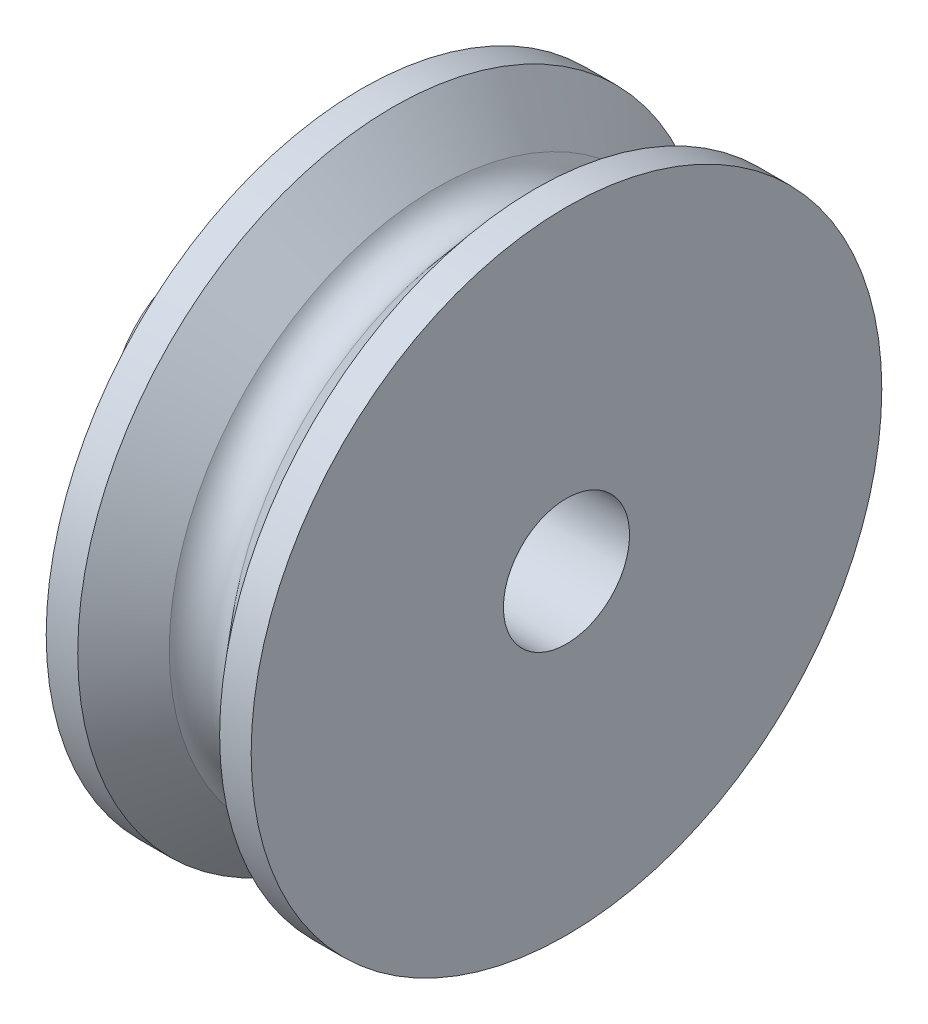
ISO-10303-21;
HEADER;
FILE_DESCRIPTION(('STEP AP214'),'2;1');
FILE_NAME('part.step','',(''),(''),'','','');
FILE_SCHEMA(('AUTOMOTIVE_DESIGN { 1 0 10303 214 1 1 1 1 }'));
ENDSEC;
DATA;
#1=APPLICATION_CONTEXT('core data for automotive mechanical design processes');
#2=APPLICATION_PROTOCOL_DEFINITION('international standard','automotive_design',2000,#1);
#3=PRODUCT_CONTEXT('',#1,'mechanical');
#4=PRODUCT('Part','Part','',(#3));
#5=PRODUCT_RELATED_PRODUCT_CATEGORY('part','',(#4));
#6=PRODUCT_DEFINITION_FORMATION('','',#4);
#7=PRODUCT_DEFINITION_CONTEXT('part definition',#1,'design');
#8=PRODUCT_DEFINITION('design','',#6,#7);
#9=PRODUCT_DEFINITION_SHAPE('','',#8);
#10=(LENGTH_UNIT() NAMED_UNIT(*) SI_UNIT(.MILLI.,.METRE.));
#11=(NAMED_UNIT(*) PLANE_ANGLE_UNIT() SI_UNIT($,.RADIAN.));
#12=(NAMED_UNIT(*) SI_UNIT($,.STERADIAN.) SOLID_ANGLE_UNIT());
#13=UNCERTAINTY_MEASURE_WITH_UNIT(LENGTH_MEASURE(1.E-05),#10,'distance_accuracy_value','');
#14=(GEOMETRIC_REPRESENTATION_CONTEXT(3) GLOBAL_UNCERTAINTY_ASSIGNED_CONTEXT((#13)) GLOBAL_UNIT_ASSIGNED_CONTEXT((#10,
#11,#12)) REPRESENTATION_CONTEXT('',''));
#15=CARTESIAN_POINT('',(0.,0.,0.));
#16=DIRECTION('',(0.,0.,1.));
#17=DIRECTION('',(1.,0.,0.));
#18=AXIS2_PLACEMENT_3D('',#15,#16,#17);
#19=CARTESIAN_POINT('',(13.6028024720552,3.58950517302747,0.));
#20=DIRECTION('',(1.,0.,0.));
#21=DIRECTION('',(0.,0.,-1.));
#22=AXIS2_PLACEMENT_3D('',#19,#20,#21);
#23=CONICAL_SURFACE('',#22,10.,0.865452785039911);
#24=CARTESIAN_POINT('',(12.1141913521995,3.58950517302747,0.));
#25=DIRECTION('',(-1.,0.,0.));
#26=DIRECTION('',(0.,0.,1.));
#27=AXIS2_PLACEMENT_3D('',#24,#25,#26);
#28=CIRCLE('',#27,8.25170456334121);
#29=CARTESIAN_POINT('',(12.1141913521995,3.58950517302747,8.25170456334121));
#30=VERTEX_POINT('',#29);
#31=EDGE_CURVE('E10',#30,#30,#28,.T.);
#32=ORIENTED_EDGE('',*,*,#31,.F.);
#33=EDGE_LOOP('',(#32));
#34=FACE_BOUND('',#33,.T.);
#35=CARTESIAN_POINT('',(13.6028024720552,3.58950517302747,0.));
#36=DIRECTION('',(-1.,0.,0.));
#37=DIRECTION('',(0.,0.,1.));
#38=AXIS2_PLACEMENT_3D('',#35,#36,#37);
#39=CIRCLE('',#38,10.);
#40=CARTESIAN_POINT('',(13.6028024720552,3.58950517302747,10.));
#41=VERTEX_POINT('',#40);
#42=EDGE_CURVE('E113',#41,#41,#39,.T.);
#43=ORIENTED_EDGE('',*,*,#42,.T.);
#44=EDGE_LOOP('',(#43));
#45=FACE_BOUND('',#44,.T.);
#46=ADVANCED_FACE('F28',(#34,#45),#23,.T.);
#47=CARTESIAN_POINT('',(11.3528024720552,3.58950517302747,0.));
#48=DIRECTION('',(-1.,0.,0.));
#49=DIRECTION('',(0.,0.,1.));
#50=AXIS2_PLACEMENT_3D('',#47,#48,#49);
#51=TOROIDAL_SURFACE('',#50,8.9,0.999999999999998);
#52=CARTESIAN_POINT('',(11.3518537202214,3.58918915061354,-7.90000044374417));
#53=CARTESIAN_POINT('',(11.3518714736844,3.58913585956427,-7.90000042476569));
#54=CARTESIAN_POINT('',(11.3518937406141,3.58908402899116,-7.90000040147376));
#55=CARTESIAN_POINT('',(11.3519466796948,3.58898479926439,-7.90000034886006));
#56=CARTESIAN_POINT('',(11.3519773619375,3.58893740552357,-7.90000031953106));
#57=CARTESIAN_POINT('',(11.352046237394,3.5888484615792,-7.90000025818411));
#58=CARTESIAN_POINT('',(11.3520844270155,3.5888069085971,-7.90000022616745));
#59=CARTESIAN_POINT('',(11.3521672302223,3.58873081576827,-7.9000001630519));
#60=CARTESIAN_POINT('',(11.3522118422084,3.58869627418088,-7.90000013195278));
#61=CARTESIAN_POINT('',(11.3523062365588,3.5886351663562,-7.90000007416618));
#62=CARTESIAN_POINT('',(11.352356019462,3.58860860095132,-7.90000004747918));
#63=CARTESIAN_POINT('',(11.3524593405624,3.5885642040915,-7.90000000152852));
#64=CARTESIAN_POINT('',(11.3525128789072,3.58854637297978,-7.89999998226517));
#65=CARTESIAN_POINT('',(11.352622188284,3.58851995257816,-7.89999995333548));
#66=CARTESIAN_POINT('',(11.3526779592734,3.58851136311227,-7.89999994366895));
#67=CARTESIAN_POINT('',(11.3527901515986,3.58850366926686,-7.89999993502211));
#68=CARTESIAN_POINT('',(11.3528465729329,3.58850456486811,-7.89999993604177));
#69=CARTESIAN_POINT('',(11.3529584645065,3.58851581569175,-7.89999994865229));
#70=CARTESIAN_POINT('',(11.3530139347445,3.58852617092772,-7.89999996024317));
#71=CARTESIAN_POINT('',(11.3531223493053,3.58855604705347,-7.89999999268933));
#72=CARTESIAN_POINT('',(11.3531752936328,3.58857556792678,-7.90000001354461));
#73=CARTESIAN_POINT('',(11.3532771535783,3.58862322119942,-7.9000000621683));
#74=CARTESIAN_POINT('',(11.353326069194,3.58865135360366,-7.90000008993673));
#75=CARTESIAN_POINT('',(11.3534184831678,3.58871543136838,-7.90000014925609));
#76=CARTESIAN_POINT('',(11.3534619815202,3.58875137673712,-7.90000018080703));
#77=CARTESIAN_POINT('',(11.3535423261244,3.58883006004465,-7.90000024413427));
#78=CARTESIAN_POINT('',(11.3535791723746,3.58887279798504,-7.90000027591057));
#79=CARTESIAN_POINT('',(11.3536451667964,3.58896385320429,-7.90000033610598));
#80=CARTESIAN_POINT('',(11.3536743149712,3.58901217048089,-7.90000036452508));
#81=CARTESIAN_POINT('',(11.3537240858303,3.58911301281562,-7.90000041480208));
#82=CARTESIAN_POINT('',(11.3537447085131,3.58916553787453,-7.90000043665998));
#83=CARTESIAN_POINT('',(11.3537768429688,3.58927330473899,-7.90000047135023));
#84=CARTESIAN_POINT('',(11.3537883547406,3.58932854654489,-7.90000048418258));
#85=CARTESIAN_POINT('',(11.3538019405734,3.58944017871119,-7.900000499375));
#86=CARTESIAN_POINT('',(11.3538040146399,3.58949656907092,-7.90000050173508));
#87=CARTESIAN_POINT('',(11.3537986662062,3.58960889761575,-7.90000049571686));
#88=CARTESIAN_POINT('',(11.3537912437064,3.58966483580087,-7.90000048733856));
#89=CARTESIAN_POINT('',(11.3537671128425,3.5897746720614,-7.90000046078821));
#90=CARTESIAN_POINT('',(11.3537504044809,3.58982857013738,-7.90000044261617));
#91=CARTESIAN_POINT('',(11.3537081762021,3.58993279619468,-7.90000039852706));
#92=CARTESIAN_POINT('',(11.3536826562843,3.58998312417581,-7.90000037260999));
#93=CARTESIAN_POINT('',(11.35362352931,3.59007878139969,-7.90000031595281));
#94=CARTESIAN_POINT('',(11.3535899222497,3.59012411064014,-7.90000028521269));
#95=CARTESIAN_POINT('',(11.3535155750105,3.59020848359289,-7.90000022237511));
#96=CARTESIAN_POINT('',(11.3534748348327,3.59024752730599,-7.90000019027763));
#97=CARTESIAN_POINT('',(11.3533873778282,3.59031822088468,-7.90000012834409));
#98=CARTESIAN_POINT('',(11.3533406609997,3.59034987074783,-7.90000009850802));
#99=CARTESIAN_POINT('',(11.3532425768393,3.59040487817933,-7.90000004446104));
#100=CARTESIAN_POINT('',(11.3531912095055,3.59042823574436,-7.90000002025014));
#101=CARTESIAN_POINT('',(11.3530852825099,3.5904659955043,-7.89999998018314));
#102=CARTESIAN_POINT('',(11.3530307228477,3.59048039769818,-7.89999996432703));
#103=CARTESIAN_POINT('',(11.3529199600519,3.59049983786878,-7.89999994275728));
#104=CARTESIAN_POINT('',(11.35286375692,3.59050487585542,-7.89999993704363));
#105=CARTESIAN_POINT('',(11.3527513026238,3.59050544462184,-7.89999993640292));
#106=CARTESIAN_POINT('',(11.3526950514595,3.5905009754105,-7.89999994147585));
#107=CARTESIAN_POINT('',(11.3525840977476,3.5904826566554,-7.89999996183639));
#108=CARTESIAN_POINT('',(11.3525293952028,3.59046880709472,-7.89999997712401));
#109=CARTESIAN_POINT('',(11.3524230917869,3.59043212080654,-7.90000001619033));
#110=CARTESIAN_POINT('',(11.3523714909097,3.59040928409648,-7.90000003996901));
#111=CARTESIAN_POINT('',(11.352272855406,3.59035527171693,-7.90000009333665));
#112=CARTESIAN_POINT('',(11.3522258207886,3.59032409603069,-7.90000012292562));
#113=CARTESIAN_POINT('',(11.3521376522424,3.59025429006556,-7.90000018457849));
#114=CARTESIAN_POINT('',(11.3520965184267,3.59021565964383,-7.90000021664244));
#115=CARTESIAN_POINT('',(11.3520213217754,3.59013204274584,-7.90000027962835));
#116=CARTESIAN_POINT('',(11.3519872586625,3.59008705651906,-7.90000031055036));
#117=CARTESIAN_POINT('',(11.3519271713297,3.58999200934391,-7.90000036776489));
#118=CARTESIAN_POINT('',(11.3519011462713,3.58994194892553,-7.90000039405789));
#119=CARTESIAN_POINT('',(11.3518578638383,3.58983815531527,-7.9000004390595));
#120=CARTESIAN_POINT('',(11.3518406086439,3.58978442121379,-7.90000045776623));
#121=CARTESIAN_POINT('',(11.3518153580669,3.5896747979973,-7.90000048548603));
#122=CARTESIAN_POINT('',(11.3518073671057,3.58961890786644,-7.90000049449446));
#123=CARTESIAN_POINT('',(11.3518008968189,3.58950662607313,-7.90000050176884));
#124=CARTESIAN_POINT('',(11.3518024060638,3.58945023509482,-7.90000050004769));
#125=CARTESIAN_POINT('',(11.3518125115647,3.58935952478454,-7.90000048874116));
#126=CARTESIAN_POINT('',(11.3518182371521,3.58932486053975,-7.90000048234779));
#127=CARTESIAN_POINT('',(11.3518332943938,3.58925632429469,-7.90000046577914));
#128=CARTESIAN_POINT('',(11.3518426260477,3.58922245229435,-7.90000045560386));
#129=CARTESIAN_POINT('',(11.3518537202214,3.58918915061354,-7.90000044374417));
#130=B_SPLINE_CURVE_WITH_KNOTS('',3,(#52,#53,#54,#55,#56,#57,#58,#59,#60,#61,#62,#63,#64,#65,
#66,#67,#68,#69,#70,#71,#72,#73,#74,#75,#76,#77,#78,#79,#80,#81,#82,#83,#84,#85,#86,#87,#88,#89,
#90,#91,#92,#93,#94,#95,#96,#97,#98,#99,#100,#101,#102,#103,#104,#105,#106,#107,#108,#109,#110,
#111,#112,#113,#114,#115,#116,#117,#118,#119,#120,#121,#122,#123,#124,#125,#126,#127,#128,#129),
.UNSPECIFIED.,.T.,.F.,(4,2,2,2,2,2,2,2,2,2,2,2,2,2,2,2,2,2,2,2,2,2,2,2,2,2,2,2,2,2,2,2,2,2,2,2,
2,2,4),(0.,0.000168383303331985,0.000336969423987032,0.000505475071877306,0.000673938835208563,
0.000842420173697908,0.00101090813226378,0.00117939288250328,0.00134787729144232,
0.00151636194227896,0.00168484629034104,0.00185333073437396,0.00202181535675193,
0.00219030001897173,0.00235878461307888,0.00252726923848532,0.0026957538852773,
0.00286423843385754,0.00303272297452504,0.00320120746701574,0.00336969196758176,
0.00353817654520947,0.00370666110135513,0.00387514571324865,0.00404363039310219,
0.00421211509257263,0.00438059961348397,0.00454908397713156,0.00471756864456574,
0.00488605298492182,0.00505453766389895,0.00522302557166583,0.00539150686737641,
0.00555997058350119,0.0057284761634303,0.00589706213183837,0.00606544531557414,
0.00617066837894974,0.00627589143418055),.UNSPECIFIED.);
#131=CARTESIAN_POINT('',(11.3518537202214,3.58918915061354,-7.90000044374417));
#132=VERTEX_POINT('',#131);
#133=EDGE_CURVE('E71',#132,#132,#130,.T.);
#134=ORIENTED_EDGE('',*,*,#133,.T.);
#135=EDGE_LOOP('',(#134));
#136=FACE_BOUND('',#135,.T.);
#137=CARTESIAN_POINT('',(11.3518537912565,3.58918893774068,7.90000044366831));
#138=CARTESIAN_POINT('',(11.3518360305442,3.58924222634046,7.90000046264596));
#139=CARTESIAN_POINT('',(11.3518227570989,3.58929705366861,7.90000047733765));
#140=CARTESIAN_POINT('',(11.3518055936467,3.58940820439393,7.90000049644738));
#141=CARTESIAN_POINT('',(11.3518017149604,3.58946452951341,7.90000050085303));
#142=CARTESIAN_POINT('',(11.3518034724117,3.58957700951923,7.90000049887316));
#143=CARTESIAN_POINT('',(11.3518091040088,3.58963316447397,7.90000049249279));
#144=CARTESIAN_POINT('',(11.3518297138872,3.58974371631244,7.90000046966901));
#145=CARTESIAN_POINT('',(11.3518446898456,3.58979811362956,7.9000004532281));
#146=CARTESIAN_POINT('',(11.351883562575,3.58990362834206,7.90000041213752));
#147=CARTESIAN_POINT('',(11.3519074602752,3.58995474539522,7.90000038748701));
#148=CARTESIAN_POINT('',(11.3519634992787,3.59005224380432,7.90000033275528));
#149=CARTESIAN_POINT('',(11.3519956409057,3.59009862497423,7.90000030267386));
#150=CARTESIAN_POINT('',(11.3520672541623,3.59018533199568,7.90000024047323));
#151=CARTESIAN_POINT('',(11.3521067256594,3.59022565795663,7.90000020835406));
#152=CARTESIAN_POINT('',(11.3521918784865,3.59029911072664,7.90000014569866));
#153=CARTESIAN_POINT('',(11.3522375598039,3.59033223755017,7.90000011516243));
#154=CARTESIAN_POINT('',(11.352333835681,3.59039035184339,7.90000005911551));
#155=CARTESIAN_POINT('',(11.3523844302512,3.59041533929567,7.90000003360485));
#156=CARTESIAN_POINT('',(11.3524890962222,3.5904564653917,7.89999999048531));
#157=CARTESIAN_POINT('',(11.3525431676166,3.59047260405142,7.89999997287643));
#158=CARTESIAN_POINT('',(11.3526532523892,3.59049557449582,7.89999994754567));
#159=CARTESIAN_POINT('',(11.3527092657671,3.59050240628124,7.8999999398238));
#160=CARTESIAN_POINT('',(11.3528216445146,3.59050656905203,7.89999993513763));
#161=CARTESIAN_POINT('',(11.3528780098846,3.59050390002741,7.89999993817335));
#162=CARTESIAN_POINT('',(11.3529894924647,3.59048913692202,7.89999995466013));
#163=CARTESIAN_POINT('',(11.3530446096757,3.59047704284838,7.89999996811119));
#164=CARTESIAN_POINT('',(11.3531520313463,3.59044377298247,7.90000000391213));
#165=CARTESIAN_POINT('',(11.3532043358071,3.59042259719386,7.90000002626201));
#166=CARTESIAN_POINT('',(11.3533046472524,3.59037176500181,7.90000007734083));
#167=CARTESIAN_POINT('',(11.3533526542353,3.59034210859498,7.90000010606977));
#168=CARTESIAN_POINT('',(11.3534430079364,3.59027515702807,7.90000016666775));
#169=CARTESIAN_POINT('',(11.3534853546539,3.59023786186697,7.90000019853679));
#170=CARTESIAN_POINT('',(11.3535631857367,3.59015669146702,7.90000026182198));
#171=CARTESIAN_POINT('',(11.3535986700985,3.59011281622486,7.90000029323814));
#172=CARTESIAN_POINT('',(11.3536617691501,3.5900197311699,7.90000035207562));
#173=CARTESIAN_POINT('',(11.3536893838402,3.58997052135735,7.90000037949694));
#174=CARTESIAN_POINT('',(11.3537359596443,3.58986816407886,7.90000042725321));
#175=CARTESIAN_POINT('',(11.3537549207584,3.589815016613,7.90000044758816));
#176=CARTESIAN_POINT('',(11.3537836511655,3.58970629272708,7.90000047887906));
#177=CARTESIAN_POINT('',(11.353793420458,3.5896507163069,7.900000489835));
#178=CARTESIAN_POINT('',(11.3538034898893,3.58953871219555,7.90000050113271));
#179=CARTESIAN_POINT('',(11.3538037900329,3.58948228450481,7.90000050147448));
#180=CARTESIAN_POINT('',(11.353794912665,3.58937017964904,7.90000049150528));
#181=CARTESIAN_POINT('',(11.3537857351546,3.58931450248393,7.90000048119431));
#182=CARTESIAN_POINT('',(11.3537581630034,3.58920547920354,7.90000045108218));
#183=CARTESIAN_POINT('',(11.3537397683659,3.58915213308743,7.90000043128101));
#184=CARTESIAN_POINT('',(11.3536942841286,3.58904928619756,7.90000038442086));
#185=CARTESIAN_POINT('',(11.3536671945253,3.58899978542536,7.90000035736187));
#186=CARTESIAN_POINT('',(11.3536050893232,3.58890603439183,7.90000029903678));
#187=CARTESIAN_POINT('',(11.3535700737182,3.58886178413462,7.90000026777068));
#188=CARTESIAN_POINT('',(11.3534931105599,3.58877979034946,7.90000020455639));
#189=CARTESIAN_POINT('',(11.353451163014,3.58874204681467,7.90000017260822));
#190=CARTESIAN_POINT('',(11.3533615267057,3.58867413784471,7.90000011163168));
#191=CARTESIAN_POINT('',(11.353313837943,3.58864397240994,7.90000008260333));
#192=CARTESIAN_POINT('',(11.3532140728553,3.58859207589857,7.90000003073911));
#193=CARTESIAN_POINT('',(11.3531619965223,3.58857034483716,7.90000000790325));
#194=CARTESIAN_POINT('',(11.3530549347812,3.58853593407418,7.89999997099871));
#195=CARTESIAN_POINT('',(11.3529999493793,3.58852325435288,7.89999995693001));
#196=CARTESIAN_POINT('',(11.3528886301535,3.58850730612096,7.89999993914583));
#197=CARTESIAN_POINT('',(11.3528322963269,3.58850403762922,7.89999993543037));
#198=CARTESIAN_POINT('',(11.3527198785092,3.588507004693,7.89999993877163));
#199=CARTESIAN_POINT('',(11.3526637945227,3.58851324042035,7.89999994582855));
#200=CARTESIAN_POINT('',(11.3525534716457,3.58853503891469,7.89999996991887));
#201=CARTESIAN_POINT('',(11.352499232683,3.58855060131548,7.89999998695188));
#202=CARTESIAN_POINT('',(11.3523941429033,3.5885906085091,7.90000002907139));
#203=CARTESIAN_POINT('',(11.3523432917326,3.58861505237271,7.90000005415706));
#204=CARTESIAN_POINT('',(11.3522464015749,3.58867213791237,7.9000001095624));
#205=CARTESIAN_POINT('',(11.3522003637871,3.58870478162447,7.90000013988338));
#206=CARTESIAN_POINT('',(11.3521144045121,3.58877734769506,7.90000020234854));
#207=CARTESIAN_POINT('',(11.3520744859593,3.58881727352576,7.90000023449359));
#208=CARTESIAN_POINT('',(11.3520019585265,3.588903231876,7.90000029693589));
#209=CARTESIAN_POINT('',(11.3519693409113,3.58894925699189,7.9000003272353));
#210=CARTESIAN_POINT('',(11.3519230154044,3.58902789825928,7.90000037220453));
#211=CARTESIAN_POINT('',(11.3519068037506,3.58905906846873,7.9000003884739));
#212=CARTESIAN_POINT('',(11.3518777410495,3.58912293807178,7.90000041827619));
#213=CARTESIAN_POINT('',(11.351864890002,3.58915563746537,7.9000004318091));
#214=CARTESIAN_POINT('',(11.3518537912565,3.58918893774068,7.90000044366831));
#215=B_SPLINE_CURVE_WITH_KNOTS('',3,(#137,#138,#139,#140,#141,#142,#143,#144,#145,#146,#147,
#148,#149,#150,#151,#152,#153,#154,#155,#156,#157,#158,#159,#160,#161,#162,#163,#164,#165,#166,
#167,#168,#169,#170,#171,#172,#173,#174,#175,#176,#177,#178,#179,#180,#181,#182,#183,#184,#185,
#186,#187,#188,#189,#190,#191,#192,#193,#194,#195,#196,#197,#198,#199,#200,#201,#202,#203,#204,
#205,#206,#207,#208,#209,#210,#211,#212,#213,#214),.UNSPECIFIED.,.T.,.F.,(4,2,2,2,2,2,2,2,2,2,2,
2,2,2,2,2,2,2,2,2,2,2,2,2,2,2,2,2,2,2,2,2,2,2,2,2,2,2,4),(0.,0.000168383196243692,
0.000336969189646435,0.000505474720729656,0.000673938380081923,0.000842419585811394,
0.00101090740713959,0.00117939218393006,0.0013478766221292,0.00151636142088069,
0.00168484591552922,0.00185333039679881,0.0020218150554275,0.00219029958641759,
0.00235878404951457,0.00252726857998269,0.00269575313309454,0.00286423777124563,
0.00303272240177123,0.0032012070285225,0.0033696916622209,0.00353817620922467,
0.00370666073396136,0.00387514519815248,0.00404362973107888,0.00421211439629941,
0.00438059888414432,0.00454908338057635,0.0047175681802993,0.00488605261275149,
0.00505453738332601,0.00522302520022189,0.00539150640237967,0.00555996998237145,
0.00572847543376864,0.00589706144194165,0.00606544465413889,0.00617066803833871,
0.00627589142222848),.UNSPECIFIED.);
#216=CARTESIAN_POINT('',(11.3518537912565,3.58918893774068,7.90000044366831));
#217=VERTEX_POINT('',#216);
#218=EDGE_CURVE('E67',#217,#217,#215,.T.);
#219=ORIENTED_EDGE('',*,*,#218,.T.);
#220=EDGE_LOOP('',(#219));
#221=FACE_BOUND('',#220,.T.);
#222=CARTESIAN_POINT('',(10.4583752810553,3.58950517302747,0.));
#223=DIRECTION('',(-1.,0.,0.));
#224=DIRECTION('',(0.,0.,1.));
#225=AXIS2_PLACEMENT_3D('',#222,#223,#224);
#226=CIRCLE('',#225,8.45278640450004);
#227=CARTESIAN_POINT('',(10.4583752810553,3.58950517302747,8.45278640450004));
#228=VERTEX_POINT('',#227);
#229=EDGE_CURVE('E39',#228,#228,#226,.T.);
#230=ORIENTED_EDGE('',*,*,#229,.F.);
#231=EDGE_LOOP('',(#230));
#232=FACE_BOUND('',#231,.T.);
#233=ORIENTED_EDGE('',*,*,#31,.T.);
#234=EDGE_LOOP('',(#233));
#235=FACE_BOUND('',#234,.T.);
#236=ADVANCED_FACE('F75',(#136,#221,#232,#235),#51,.F.);
#237=CARTESIAN_POINT('',(9.10280247205517,3.58950517302747,0.));
#238=DIRECTION('',(-1.,0.,0.));
#239=DIRECTION('',(0.,0.,1.));
#240=AXIS2_PLACEMENT_3D('',#237,#238,#239);
#241=CONICAL_SURFACE('',#240,10.,0.851322092346765);
#242=ORIENTED_EDGE('',*,*,#229,.T.);
#243=EDGE_LOOP('',(#242));
#244=FACE_BOUND('',#243,.T.);
#245=CARTESIAN_POINT('',(9.10280247205517,3.58950517302747,0.));
#246=DIRECTION('',(-1.,0.,0.));
#247=DIRECTION('',(0.,0.,1.));
#248=AXIS2_PLACEMENT_3D('',#245,#246,#247);
#249=CIRCLE('',#248,10.);
#250=CARTESIAN_POINT('',(9.10280247205517,3.58950517302747,10.));
#251=VERTEX_POINT('',#250);
#252=EDGE_CURVE('E44',#251,#251,#249,.T.);
#253=ORIENTED_EDGE('',*,*,#252,.F.);
#254=EDGE_LOOP('',(#253));
#255=FACE_BOUND('',#254,.T.);
#256=ADVANCED_FACE('F79',(#244,#255),#241,.T.);
#257=CARTESIAN_POINT('',(8.10280247205517,3.58950517302747,0.));
#258=DIRECTION('',(-1.,0.,0.));
#259=DIRECTION('',(0.,0.,1.));
#260=AXIS2_PLACEMENT_3D('',#257,#258,#259);
#261=CYLINDRICAL_SURFACE('',#260,10.);
#262=ORIENTED_EDGE('',*,*,#252,.T.);
#263=EDGE_LOOP('',(#262));
#264=FACE_BOUND('',#263,.T.);
#265=CARTESIAN_POINT('',(8.10280247205517,3.58950517302747,0.));
#266=DIRECTION('',(-1.,0.,0.));
#267=DIRECTION('',(0.,0.,1.));
#268=AXIS2_PLACEMENT_3D('',#265,#266,#267);
#269=CIRCLE('',#268,10.);
#270=CARTESIAN_POINT('',(8.10280247205517,3.58950517302747,10.));
#271=VERTEX_POINT('',#270);
#272=EDGE_CURVE('E131',#271,#271,#269,.T.);
#273=ORIENTED_EDGE('',*,*,#272,.F.);
#274=EDGE_LOOP('',(#273));
#275=FACE_BOUND('',#274,.T.);
#276=ADVANCED_FACE('F84',(#264,#275),#261,.T.);
#277=CARTESIAN_POINT('',(8.10280247205517,-7.08683692912308,0.));
#278=DIRECTION('',(-1.,0.,0.));
#279=DIRECTION('',(0.,0.,1.));
#280=AXIS2_PLACEMENT_3D('',#277,#278,#279);
#281=PLANE('',#280);
#282=ORIENTED_EDGE('',*,*,#272,.T.);
#283=EDGE_LOOP('',(#282));
#284=FACE_BOUND('',#283,.T.);
#285=CARTESIAN_POINT('',(8.10280247205517,3.58950517302747,0.));
#286=DIRECTION('',(-1.,0.,0.));
#287=DIRECTION('',(0.,0.,1.));
#288=AXIS2_PLACEMENT_3D('',#285,#286,#287);
#289=CIRCLE('',#288,3.);
#290=CARTESIAN_POINT('',(8.10280247205517,3.58950517302747,3.));
#291=VERTEX_POINT('',#290);
#292=EDGE_CURVE('E128',#291,#291,#289,.T.);
#293=ORIENTED_EDGE('',*,*,#292,.F.);
#294=EDGE_LOOP('',(#293));
#295=FACE_BOUND('',#294,.T.);
#296=ADVANCED_FACE('F88',(#284,#295),#281,.T.);
#297=CARTESIAN_POINT('',(8.10280247205517,3.58950517302747,0.));
#298=DIRECTION('',(-1.,0.,0.));
#299=DIRECTION('',(0.,0.,1.));
#300=AXIS2_PLACEMENT_3D('',#297,#298,#299);
#301=CYLINDRICAL_SURFACE('',#300,3.);
#302=ORIENTED_EDGE('',*,*,#292,.T.);
#303=EDGE_LOOP('',(#302));
#304=FACE_BOUND('',#303,.T.);
#305=CARTESIAN_POINT('',(3.10280247205517,3.58950517302747,0.));
#306=DIRECTION('',(-1.,0.,0.));
#307=DIRECTION('',(0.,0.,1.));
#308=AXIS2_PLACEMENT_3D('',#305,#306,#307);
#309=CIRCLE('',#308,3.);
#310=CARTESIAN_POINT('',(3.10280247205517,3.58950517302747,3.));
#311=VERTEX_POINT('',#310);
#312=EDGE_CURVE('E126',#311,#311,#309,.T.);
#313=ORIENTED_EDGE('',*,*,#312,.F.);
#314=EDGE_LOOP('',(#313));
#315=FACE_BOUND('',#314,.T.);
#316=ADVANCED_FACE('F92',(#304,#315),#301,.T.);
#317=CARTESIAN_POINT('',(3.10280247205517,-7.08683692912308,0.));
#318=DIRECTION('',(-1.,0.,0.));
#319=DIRECTION('',(0.,0.,1.));
#320=AXIS2_PLACEMENT_3D('',#317,#318,#319);
#321=PLANE('',#320);
#322=ORIENTED_EDGE('',*,*,#312,.T.);
#323=EDGE_LOOP('',(#322));
#324=FACE_BOUND('',#323,.T.);
#325=CARTESIAN_POINT('',(3.10280247205517,3.58950517302747,0.));
#326=DIRECTION('',(-1.,0.,0.));
#327=DIRECTION('',(0.,0.,1.));
#328=AXIS2_PLACEMENT_3D('',#325,#326,#327);
#329=CIRCLE('',#328,2.);
#330=CARTESIAN_POINT('',(3.10280247205517,3.58950517302747,2.));
#331=VERTEX_POINT('',#330);
#332=EDGE_CURVE('E123',#331,#331,#329,.T.);
#333=ORIENTED_EDGE('',*,*,#332,.F.);
#334=EDGE_LOOP('',(#333));
#335=FACE_BOUND('',#334,.T.);
#336=ADVANCED_FACE('F95',(#324,#335),#321,.T.);
#337=CARTESIAN_POINT('',(8.10280247205517,3.58950517302747,0.));
#338=DIRECTION('',(-1.,0.,0.));
#339=DIRECTION('',(0.,0.,1.));
#340=AXIS2_PLACEMENT_3D('',#337,#338,#339);
#341=CYLINDRICAL_SURFACE('',#340,2.);
#342=CARTESIAN_POINT('',(11.3538024720552,3.58950517302747,2.));
#343=CARTESIAN_POINT('',(11.3538024695644,3.58944900256326,1.99999999999662));
#344=CARTESIAN_POINT('',(11.353797723493,3.5893927913701,1.99999999760825));
#345=CARTESIAN_POINT('',(11.3537788563355,3.58928191707074,1.99999998831018));
#346=CARTESIAN_POINT('',(11.3537647239651,3.58922725591059,1.99999998139503));
#347=CARTESIAN_POINT('',(11.3537274865226,3.58912110401534,1.99999996382677));
#348=CARTESIAN_POINT('',(11.3537043857361,3.5890696117795,1.99999995317544));
#349=CARTESIAN_POINT('',(11.3536498730996,3.58897125091215,1.99999992933731));
#350=CARTESIAN_POINT('',(11.3536184633163,3.58892438113491,1.99999991615114));
#351=CARTESIAN_POINT('',(11.353548217964,3.588836574259,1.99999988872673));
#352=CARTESIAN_POINT('',(11.3535093816217,3.58879563777904,1.99999987448838));
#353=CARTESIAN_POINT('',(11.3534253859768,3.58872086441177,1.99999984656542));
#354=CARTESIAN_POINT('',(11.3533802264261,3.58868702780327,1.99999983288083));
#355=CARTESIAN_POINT('',(11.3532848684176,3.58862741718305,1.99999980760911));
#356=CARTESIAN_POINT('',(11.3532346700535,3.58860164302161,1.99999979602194));
#357=CARTESIAN_POINT('',(11.3531306588062,3.58855888816882,1.99999977625116));
#358=CARTESIAN_POINT('',(11.3530768459302,3.58854190745979,1.99999976806753));
#359=CARTESIAN_POINT('',(11.3529671330548,3.58851722143891,1.9999997560264));
#360=CARTESIAN_POINT('',(11.3529112330517,3.58850951614394,1.99999975216891));
#361=CARTESIAN_POINT('',(11.3527989329569,3.58850359974096,1.99999974921501));
#362=CARTESIAN_POINT('',(11.3527425328661,3.58850538861584,1.99999975011859));
#363=CARTESIAN_POINT('',(11.3526308335104,3.5885184097389,1.99999975658492));
#364=CARTESIAN_POINT('',(11.3525755342459,3.58852964198976,1.99999976214767));
#365=CARTESIAN_POINT('',(11.3524676062828,3.58856123102924,1.99999977730521));
#366=CARTESIAN_POINT('',(11.3524149775871,3.5885815878275,1.99999978690001));
#367=CARTESIAN_POINT('',(11.3523138848158,3.58863084809234,1.99999980903988));
#368=CARTESIAN_POINT('',(11.3522654207391,3.58865975155654,1.99999982158495));
#369=CARTESIAN_POINT('',(11.3521740329574,3.58872528465245,1.99999984821103));
#370=CARTESIAN_POINT('',(11.3521311092502,3.58876191428104,1.99999986229203));
#371=CARTESIAN_POINT('',(11.3520520206553,3.58884185992045,1.99999989040243));
#372=CARTESIAN_POINT('',(11.3520158557692,3.58888517593291,1.99999990443183));
#373=CARTESIAN_POINT('',(11.3519513114355,3.58897726472206,1.99999993085732));
#374=CARTESIAN_POINT('',(11.3519229319889,3.58902603749946,1.99999994325342));
#375=CARTESIAN_POINT('',(11.3518747641556,3.58912765529908,1.99999996501474));
#376=CARTESIAN_POINT('',(11.3518549757686,3.58918050032115,1.99999997437995));
#377=CARTESIAN_POINT('',(11.3518245517827,3.58928876249241,1.99999998902366));
#378=CARTESIAN_POINT('',(11.3518139161834,3.5893441796415,1.99999999430215));
#379=CARTESIAN_POINT('',(11.3518020996912,3.58945601293384,2.00000000017729));
#380=CARTESIAN_POINT('',(11.3518009187974,3.58951242907699,2.00000000077394));
#381=CARTESIAN_POINT('',(11.3518080452301,3.58962465887716,1.99999999721812));
#382=CARTESIAN_POINT('',(11.3518163525571,3.58968047253415,1.99999999306566));
#383=CARTESIAN_POINT('',(11.3518422196169,3.5897899129724,1.9999999804798));
#384=CARTESIAN_POINT('',(11.3518597793496,3.58984353975368,1.99999997204639));
#385=CARTESIAN_POINT('',(11.3519036527432,3.58994708412948,1.99999995184942));
#386=CARTESIAN_POINT('',(11.3519299664028,3.5899970017245,1.99999994008587));
#387=CARTESIAN_POINT('',(11.351990600687,3.59009171071749,1.99999991455487));
#388=CARTESIAN_POINT('',(11.3520249213111,3.59013650211572,1.99999990078742));
#389=CARTESIAN_POINT('',(11.3521005952747,3.59021968724346,1.9999998728008));
#390=CARTESIAN_POINT('',(11.352141948617,3.59025808097036,1.99999985858163));
#391=CARTESIAN_POINT('',(11.35223051413,3.59032738085838,1.99999983129465));
#392=CARTESIAN_POINT('',(11.352277726303,3.5903582870164,1.99999981822686));
#393=CARTESIAN_POINT('',(11.3523766691923,3.59041173438656,1.99999979471596));
#394=CARTESIAN_POINT('',(11.3524283999038,3.59043427560755,1.99999978427286));
#395=CARTESIAN_POINT('',(11.3525349114113,3.59047035325839,1.9999997671887));
#396=CARTESIAN_POINT('',(11.3525896922061,3.59048388969204,1.99999976054765));
#397=CARTESIAN_POINT('',(11.3527007489363,3.59050157354502,1.99999975181633));
#398=CARTESIAN_POINT('',(11.3527570248744,3.59050572094745,1.99999974972607));
#399=CARTESIAN_POINT('',(11.352869474171,3.5905045089533,1.99999975033199));
#400=CARTESIAN_POINT('',(11.3529256475296,3.59049914957588,1.99999975302816));
#401=CARTESIAN_POINT('',(11.3530362973003,3.59047907617207,1.999999762903));
#402=CARTESIAN_POINT('',(11.353090773709,3.59046436212686,1.99999977008167));
#403=CARTESIAN_POINT('',(11.3531964840171,3.59042599673167,1.99999978811231));
#404=CARTESIAN_POINT('',(11.3532477178562,3.59040234521523,1.99999979896434));
#405=CARTESIAN_POINT('',(11.3533454855759,3.59034677728107,1.9999998231177));
#406=CARTESIAN_POINT('',(11.3533920196411,3.59031486118787,1.99999983641892));
#407=CARTESIAN_POINT('',(11.3534790645677,3.59024367389401,1.99999986396992));
#408=CARTESIAN_POINT('',(11.3535195760583,3.59020440346246,1.9999998782196));
#409=CARTESIAN_POINT('',(11.3535934413607,3.5901196072741,1.99999990606603));
#410=CARTESIAN_POINT('',(11.3536267933911,3.59007407996493,1.99999991966262));
#411=CARTESIAN_POINT('',(11.353685393239,3.58997805445283,1.99999994467201));
#412=CARTESIAN_POINT('',(11.3537106371787,3.58992755388638,1.99999995608375));
#413=CARTESIAN_POINT('',(11.3537522593527,3.58982307104431,1.99999997541465));
#414=CARTESIAN_POINT('',(11.3537686482154,3.58976909303007,1.99999998333799));
#415=CARTESIAN_POINT('',(11.3537877270129,3.58967983801375,1.9999999926694));
#416=CARTESIAN_POINT('',(11.3537932495025,3.58964514097137,1.99999999540653));
#417=CARTESIAN_POINT('',(11.3538006228019,3.58957535893003,1.99999999907289));
#418=CARTESIAN_POINT('',(11.3538024736116,3.58954027393107,2.00000000000211));
#419=CARTESIAN_POINT('',(11.3538024720552,3.58950517302747,2.));
#420=B_SPLINE_CURVE_WITH_KNOTS('',3,(#342,#343,#344,#345,#346,#347,#348,#349,#350,#351,#352,
#353,#354,#355,#356,#357,#358,#359,#360,#361,#362,#363,#364,#365,#366,#367,#368,#369,#370,#371,
#372,#373,#374,#375,#376,#377,#378,#379,#380,#381,#382,#383,#384,#385,#386,#387,#388,#389,#390,
#391,#392,#393,#394,#395,#396,#397,#398,#399,#400,#401,#402,#403,#404,#405,#406,#407,#408,#409,
#410,#411,#412,#413,#414,#415,#416,#417,#418,#419),.UNSPECIFIED.,.T.,.F.,(4,2,2,2,2,2,2,2,2,2,2,
2,2,2,2,2,2,2,2,2,2,2,2,2,2,2,2,2,2,2,2,2,2,2,2,2,2,2,4),(0.,0.000168383274452756,
0.000336969347878736,0.000505474957239624,0.000673938695005263,0.000842419986965003,
0.00101090789366594,0.0011793926711878,0.00134787710989044,0.00151636185548246,
0.00168484629735195,0.00185333078702569,0.0020218154546169,0.00219030007504218,
0.00235878462739234,0.00252726922126907,0.00269575383716913,0.00286423844628633,
0.00303272304768623,0.00320120763083663,0.0033696922215213,0.00353817681097731,
0.0037066613785156,0.00387514593750604,0.00404363056479648,0.00421211526174458,
0.00438059978077484,0.00454908422890286,0.00471756898050708,0.00488605339255008,
0.00505453814340729,0.00522302603235439,0.00539150730638334,0.00555997097042036,
0.00572847650620839,0.00589706251354348,0.0060654457217233,0.00617066837133018,
0.00627589102113945),.UNSPECIFIED.);
#421=CARTESIAN_POINT('',(11.3538024720552,3.58950517302747,2.));
#422=VERTEX_POINT('',#421);
#423=EDGE_CURVE('E31',#422,#422,#420,.T.);
#424=ORIENTED_EDGE('',*,*,#423,.F.);
#425=EDGE_LOOP('',(#424));
#426=FACE_BOUND('',#425,.T.);
#427=CARTESIAN_POINT('',(11.3538024720552,3.58950517302747,-2.00000000000001));
#428=CARTESIAN_POINT('',(11.3538024695644,3.58956134349167,-1.99999999999663));
#429=CARTESIAN_POINT('',(11.353797723493,3.58961755468484,-1.99999999760825));
#430=CARTESIAN_POINT('',(11.3537788563355,3.5897284289842,-1.99999998831017));
#431=CARTESIAN_POINT('',(11.3537647239651,3.58978309014435,-1.99999998139503));
#432=CARTESIAN_POINT('',(11.3537274865226,3.5898892420396,-1.99999996382677));
#433=CARTESIAN_POINT('',(11.3537043857361,3.58994073427544,-1.99999995317544));
#434=CARTESIAN_POINT('',(11.3536498730996,3.59003909514279,-1.99999992933731));
#435=CARTESIAN_POINT('',(11.3536184633163,3.59008596492003,-1.99999991615114));
#436=CARTESIAN_POINT('',(11.353548217964,3.59017377179593,-1.99999988872673));
#437=CARTESIAN_POINT('',(11.3535093816217,3.5902147082759,-1.99999987448838));
#438=CARTESIAN_POINT('',(11.3534253859768,3.59028948164317,-1.99999984656542));
#439=CARTESIAN_POINT('',(11.3533802264261,3.59032331825167,-1.99999983288083));
#440=CARTESIAN_POINT('',(11.3532848684176,3.59038292887189,-1.99999980760911));
#441=CARTESIAN_POINT('',(11.3532346700535,3.59040870303333,-1.99999979602194));
#442=CARTESIAN_POINT('',(11.3531306588062,3.59045145788612,-1.99999977625116));
#443=CARTESIAN_POINT('',(11.3530768459302,3.59046843859514,-1.99999976806753));
#444=CARTESIAN_POINT('',(11.3529671330548,3.59049312461603,-1.9999997560264));
#445=CARTESIAN_POINT('',(11.3529112330517,3.590500829911,-1.99999975216891));
#446=CARTESIAN_POINT('',(11.3527989329569,3.59050674631398,-1.99999974921501));
#447=CARTESIAN_POINT('',(11.3527425328661,3.5905049574391,-1.99999975011859));
#448=CARTESIAN_POINT('',(11.3526308335104,3.59049193631604,-1.99999975658492));
#449=CARTESIAN_POINT('',(11.3525755342459,3.59048070406517,-1.99999976214767));
#450=CARTESIAN_POINT('',(11.3524676062828,3.59044911502569,-1.99999977730521));
#451=CARTESIAN_POINT('',(11.3524149775871,3.59042875822744,-1.99999978690001));
#452=CARTESIAN_POINT('',(11.3523138848158,3.59037949796259,-1.99999980903988));
#453=CARTESIAN_POINT('',(11.3522654207391,3.5903505944984,-1.99999982158495));
#454=CARTESIAN_POINT('',(11.3521740329574,3.59028506140249,-1.99999984821103));
#455=CARTESIAN_POINT('',(11.3521311092502,3.59024843177389,-1.99999986229203));
#456=CARTESIAN_POINT('',(11.3520520206553,3.59016848613449,-1.99999989040243));
#457=CARTESIAN_POINT('',(11.3520158557692,3.59012517012203,-1.99999990443183));
#458=CARTESIAN_POINT('',(11.3519513114355,3.59003308133288,-1.99999993085732));
#459=CARTESIAN_POINT('',(11.3519229319889,3.58998430855548,-1.99999994325342));
#460=CARTESIAN_POINT('',(11.3518747641556,3.58988269075585,-1.99999996501474));
#461=CARTESIAN_POINT('',(11.3518549757686,3.58982984573379,-1.99999997437995));
#462=CARTESIAN_POINT('',(11.3518245517827,3.58972158356252,-1.99999998902366));
#463=CARTESIAN_POINT('',(11.3518139161834,3.58966616641344,-1.99999999430215));
#464=CARTESIAN_POINT('',(11.3518020996912,3.5895543331211,-2.00000000017729));
#465=CARTESIAN_POINT('',(11.3518009187974,3.58949791697795,-2.00000000077394));
#466=CARTESIAN_POINT('',(11.3518080452301,3.58938568717778,-1.99999999721812));
#467=CARTESIAN_POINT('',(11.3518163525571,3.58932987352079,-1.99999999306566));
#468=CARTESIAN_POINT('',(11.3518422196169,3.58922043308253,-1.9999999804798));
#469=CARTESIAN_POINT('',(11.3518597793496,3.58916680630126,-1.99999997204639));
#470=CARTESIAN_POINT('',(11.3519036527432,3.58906326192546,-1.99999995184942));
#471=CARTESIAN_POINT('',(11.3519299664028,3.58901334433044,-1.99999994008587));
#472=CARTESIAN_POINT('',(11.351990600687,3.58891863533745,-1.99999991455487));
#473=CARTESIAN_POINT('',(11.3520249213111,3.58887384393922,-1.99999990078742));
#474=CARTESIAN_POINT('',(11.3521005952747,3.58879065881148,-1.9999998728008));
#475=CARTESIAN_POINT('',(11.352141948617,3.58875226508457,-1.99999985858163));
#476=CARTESIAN_POINT('',(11.35223051413,3.58868296519656,-1.99999983129465));
#477=CARTESIAN_POINT('',(11.352277726303,3.58865205903854,-1.99999981822686));
#478=CARTESIAN_POINT('',(11.3523766691923,3.58859861166837,-1.99999979471596));
#479=CARTESIAN_POINT('',(11.3524283999038,3.58857607044739,-1.99999978427286));
#480=CARTESIAN_POINT('',(11.3525349114113,3.58853999279655,-1.9999997671887));
#481=CARTESIAN_POINT('',(11.3525896922061,3.5885264563629,-1.99999976054765));
#482=CARTESIAN_POINT('',(11.3527007489363,3.58850877250992,-1.99999975181633));
#483=CARTESIAN_POINT('',(11.3527570248744,3.58850462510749,-1.99999974972607));
#484=CARTESIAN_POINT('',(11.352869474171,3.58850583710164,-1.99999975033199));
#485=CARTESIAN_POINT('',(11.3529256475296,3.58851119647906,-1.99999975302816));
#486=CARTESIAN_POINT('',(11.3530362973003,3.58853126988287,-1.999999762903));
#487=CARTESIAN_POINT('',(11.353090773709,3.58854598392807,-1.99999977008167));
#488=CARTESIAN_POINT('',(11.3531964840171,3.58858434932326,-1.99999978811231));
#489=CARTESIAN_POINT('',(11.3532477178562,3.58860800083971,-1.99999979896434));
#490=CARTESIAN_POINT('',(11.3533454855759,3.58866356877387,-1.9999998231177));
#491=CARTESIAN_POINT('',(11.3533920196411,3.58869548486707,-1.99999983641892));
#492=CARTESIAN_POINT('',(11.3534790645677,3.58876667216093,-1.99999986396992));
#493=CARTESIAN_POINT('',(11.3535195760583,3.58880594259247,-1.9999998782196));
#494=CARTESIAN_POINT('',(11.3535934413607,3.58889073878084,-1.99999990606603));
#495=CARTESIAN_POINT('',(11.3536267933911,3.58893626609001,-1.99999991966262));
#496=CARTESIAN_POINT('',(11.353685393239,3.58903229160211,-1.99999994467201));
#497=CARTESIAN_POINT('',(11.3537106371787,3.58908279216856,-1.99999995608375));
#498=CARTESIAN_POINT('',(11.3537522593527,3.58918727501063,-1.99999997541465));
#499=CARTESIAN_POINT('',(11.3537686482154,3.58924125302486,-1.99999998333799));
#500=CARTESIAN_POINT('',(11.3537877270129,3.58933050804119,-1.9999999926694));
#501=CARTESIAN_POINT('',(11.3537932495025,3.58936520508357,-1.99999999540653));
#502=CARTESIAN_POINT('',(11.3538006228019,3.58943498712491,-1.99999999907289));
#503=CARTESIAN_POINT('',(11.3538024736116,3.58947007212387,-2.00000000000212));
#504=CARTESIAN_POINT('',(11.3538024720552,3.58950517302747,-2.00000000000001));
#505=B_SPLINE_CURVE_WITH_KNOTS('',3,(#427,#428,#429,#430,#431,#432,#433,#434,#435,#436,#437,
#438,#439,#440,#441,#442,#443,#444,#445,#446,#447,#448,#449,#450,#451,#452,#453,#454,#455,#456,
#457,#458,#459,#460,#461,#462,#463,#464,#465,#466,#467,#468,#469,#470,#471,#472,#473,#474,#475,
#476,#477,#478,#479,#480,#481,#482,#483,#484,#485,#486,#487,#488,#489,#490,#491,#492,#493,#494,
#495,#496,#497,#498,#499,#500,#501,#502,#503,#504),.UNSPECIFIED.,.T.,.F.,(4,2,2,2,2,2,2,2,2,2,2,
2,2,2,2,2,2,2,2,2,2,2,2,2,2,2,2,2,2,2,2,2,2,2,2,2,2,2,4),(0.,0.000168383274452756,
0.000336969347878736,0.000505474957239624,0.000673938695005264,0.000842419986965003,
0.00101090789366594,0.0011793926711878,0.00134787710989044,0.00151636185548246,
0.00168484629735195,0.00185333078702569,0.0020218154546169,0.00219030007504218,
0.00235878462739235,0.00252726922126841,0.00269575383716922,0.0028642384462854,
0.00303272304768605,0.00320120763083689,0.00336969222152112,0.00353817681097714,
0.00370666137851543,0.00387514593750586,0.00404363056479631,0.00421211526174248,
0.00438059978077468,0.0045490842289027,0.00471756898050692,0.00488605339254992,
0.00505453814340713,0.00522302603235616,0.00539150730638319,0.00555997097042022,
0.00572847650620825,0.00589706251354333,0.00606544572172316,0.00617066837133003,
0.0062758910211393),.UNSPECIFIED.);
#506=CARTESIAN_POINT('',(11.3538024720552,3.58950517302747,-2.00000000000001));
#507=VERTEX_POINT('',#506);
#508=EDGE_CURVE('E47',#507,#507,#505,.T.);
#509=ORIENTED_EDGE('',*,*,#508,.F.);
#510=EDGE_LOOP('',(#509));
#511=FACE_BOUND('',#510,.T.);
#512=ORIENTED_EDGE('',*,*,#332,.T.);
#513=EDGE_LOOP('',(#512));
#514=FACE_BOUND('',#513,.T.);
#515=CARTESIAN_POINT('',(14.6028024720552,3.58950517302747,0.));
#516=DIRECTION('',(-1.,0.,0.));
#517=DIRECTION('',(0.,0.,1.));
#518=AXIS2_PLACEMENT_3D('',#515,#516,#517);
#519=CIRCLE('',#518,2.);
#520=CARTESIAN_POINT('',(14.6028024720552,3.58950517302747,2.));
#521=VERTEX_POINT('',#520);
#522=EDGE_CURVE('E117',#521,#521,#519,.T.);
#523=ORIENTED_EDGE('',*,*,#522,.F.);
#524=EDGE_LOOP('',(#523));
#525=FACE_BOUND('',#524,.T.);
#526=ADVANCED_FACE('F51',(#426,#511,#514,#525),#341,.F.);
#527=CARTESIAN_POINT('',(14.6028024720552,-7.08683692912308,0.));
#528=DIRECTION('',(-1.,0.,0.));
#529=DIRECTION('',(0.,0.,1.));
#530=AXIS2_PLACEMENT_3D('',#527,#528,#529);
#531=PLANE('',#530);
#532=CARTESIAN_POINT('',(14.6028024720552,3.58950517302747,0.));
#533=DIRECTION('',(-1.,0.,0.));
#534=DIRECTION('',(0.,0.,1.));
#535=AXIS2_PLACEMENT_3D('',#532,#533,#534);
#536=CIRCLE('',#535,10.);
#537=CARTESIAN_POINT('',(14.6028024720552,3.58950517302747,10.));
#538=VERTEX_POINT('',#537);
#539=EDGE_CURVE('E115',#538,#538,#536,.T.);
#540=ORIENTED_EDGE('',*,*,#539,.F.);
#541=EDGE_LOOP('',(#540));
#542=FACE_BOUND('',#541,.T.);
#543=ORIENTED_EDGE('',*,*,#522,.T.);
#544=EDGE_LOOP('',(#543));
#545=FACE_BOUND('',#544,.T.);
#546=ADVANCED_FACE('F102',(#542,#545),#531,.F.);
#547=CARTESIAN_POINT('',(8.10280247205517,3.58950517302747,0.));
#548=DIRECTION('',(-1.,0.,0.));
#549=DIRECTION('',(0.,0.,1.));
#550=AXIS2_PLACEMENT_3D('',#547,#548,#549);
#551=CYLINDRICAL_SURFACE('',#550,10.);
#552=ORIENTED_EDGE('',*,*,#42,.F.);
#553=EDGE_LOOP('',(#552));
#554=FACE_BOUND('',#553,.T.);
#555=ORIENTED_EDGE('',*,*,#539,.T.);
#556=EDGE_LOOP('',(#555));
#557=FACE_BOUND('',#556,.T.);
#558=ADVANCED_FACE('F60',(#554,#557),#551,.T.);
#559=CARTESIAN_POINT('',(11.3528024720552,3.58950517302747,-45.));
#560=DIRECTION('',(0.,0.,1.));
#561=DIRECTION('',(1.,0.,0.));
#562=AXIS2_PLACEMENT_3D('',#559,#560,#561);
#563=CYLINDRICAL_SURFACE('',#562,0.000999999999998581);
#564=ORIENTED_EDGE('',*,*,#508,.T.);
#565=EDGE_LOOP('',(#564));
#566=FACE_BOUND('',#565,.T.);
#567=ORIENTED_EDGE('',*,*,#133,.F.);
#568=EDGE_LOOP('',(#567));
#569=FACE_BOUND('',#568,.T.);
#570=ADVANCED_FACE('F55',(#566,#569),#563,.F.);
#571=ORIENTED_EDGE('',*,*,#423,.T.);
#572=EDGE_LOOP('',(#571));
#573=FACE_BOUND('',#572,.T.);
#574=ORIENTED_EDGE('',*,*,#218,.F.);
#575=EDGE_LOOP('',(#574));
#576=FACE_BOUND('',#575,.T.);
#577=ADVANCED_FACE('F59',(#573,#576),#563,.F.);
#578=CLOSED_SHELL('',(#46,#236,#256,#276,#296,#316,#336,#526,#546,#558,#570,#577));
#579=MANIFOLD_SOLID_BREP('B2',#578);
#580=ADVANCED_BREP_SHAPE_REPRESENTATION('',(#18,#579),#14);
#581=SHAPE_DEFINITION_REPRESENTATION(#9,#580);
ENDSEC;
END-ISO-10303-21;
